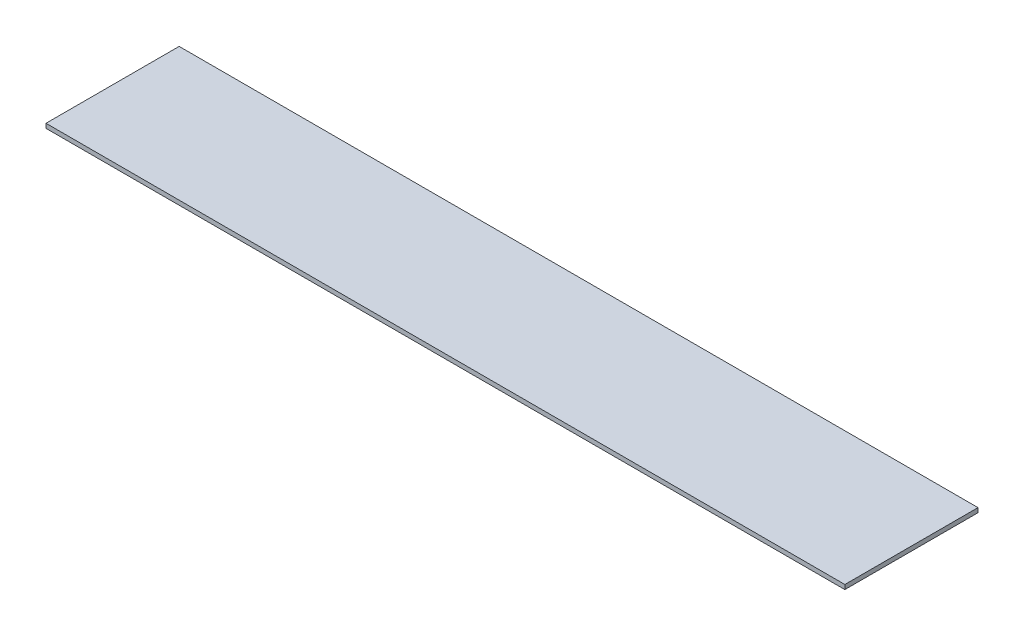
ISO-10303-21;
HEADER;
FILE_DESCRIPTION(('STEP AP214'),'2;1');
FILE_NAME('part.step','',(''),(''),'','','');
FILE_SCHEMA(('AUTOMOTIVE_DESIGN { 1 0 10303 214 1 1 1 1 }'));
ENDSEC;
DATA;
#1=APPLICATION_CONTEXT('core data for automotive mechanical design processes');
#2=APPLICATION_PROTOCOL_DEFINITION('international standard','automotive_design',2000,#1);
#3=PRODUCT_CONTEXT('',#1,'mechanical');
#4=PRODUCT('Part','Part','',(#3));
#5=PRODUCT_RELATED_PRODUCT_CATEGORY('part','',(#4));
#6=PRODUCT_DEFINITION_FORMATION('','',#4);
#7=PRODUCT_DEFINITION_CONTEXT('part definition',#1,'design');
#8=PRODUCT_DEFINITION('design','',#6,#7);
#9=PRODUCT_DEFINITION_SHAPE('','',#8);
#10=(LENGTH_UNIT() NAMED_UNIT(*) SI_UNIT(.MILLI.,.METRE.));
#11=(NAMED_UNIT(*) PLANE_ANGLE_UNIT() SI_UNIT($,.RADIAN.));
#12=(NAMED_UNIT(*) SI_UNIT($,.STERADIAN.) SOLID_ANGLE_UNIT());
#13=UNCERTAINTY_MEASURE_WITH_UNIT(LENGTH_MEASURE(1.E-05),#10,'distance_accuracy_value','');
#14=(GEOMETRIC_REPRESENTATION_CONTEXT(3) GLOBAL_UNCERTAINTY_ASSIGNED_CONTEXT((#13)) GLOBAL_UNIT_ASSIGNED_CONTEXT((#10,
#11,#12)) REPRESENTATION_CONTEXT('',''));
#15=CARTESIAN_POINT('',(0.,0.,0.));
#16=DIRECTION('',(0.,0.,1.));
#17=DIRECTION('',(1.,0.,0.));
#18=AXIS2_PLACEMENT_3D('',#15,#16,#17);
#19=CARTESIAN_POINT('',(450.,5.,75.));
#20=DIRECTION('',(-1.,0.,0.));
#21=DIRECTION('',(0.,0.,1.));
#22=AXIS2_PLACEMENT_3D('',#19,#20,#21);
#23=PLANE('',#22);
#24=DIRECTION('',(0.,0.,-1.));
#25=VECTOR('',#24,1.);
#26=CARTESIAN_POINT('',(450.,0.,75.));
#27=LINE('',#26,#25);
#28=CARTESIAN_POINT('',(450.,0.,75.));
#29=VERTEX_POINT('',#28);
#30=CARTESIAN_POINT('',(450.,0.,-75.));
#31=VERTEX_POINT('',#30);
#32=EDGE_CURVE('E96',#29,#31,#27,.T.);
#33=ORIENTED_EDGE('',*,*,#32,.T.);
#34=DIRECTION('',(0.,-1.,0.));
#35=VECTOR('',#34,1.);
#36=CARTESIAN_POINT('',(450.,5.,-75.));
#37=LINE('',#36,#35);
#38=CARTESIAN_POINT('',(450.,5.,-75.));
#39=VERTEX_POINT('',#38);
#40=EDGE_CURVE('E11',#39,#31,#37,.T.);
#41=ORIENTED_EDGE('',*,*,#40,.F.);
#42=DIRECTION('',(0.,0.,-1.));
#43=VECTOR('',#42,1.);
#44=CARTESIAN_POINT('',(450.,5.,75.));
#45=LINE('',#44,#43);
#46=CARTESIAN_POINT('',(450.,5.,75.));
#47=VERTEX_POINT('',#46);
#48=EDGE_CURVE('E84',#47,#39,#45,.T.);
#49=ORIENTED_EDGE('',*,*,#48,.F.);
#50=DIRECTION('',(0.,-1.,0.));
#51=VECTOR('',#50,1.);
#52=CARTESIAN_POINT('',(450.,5.,75.));
#53=LINE('',#52,#51);
#54=EDGE_CURVE('E92',#47,#29,#53,.T.);
#55=ORIENTED_EDGE('',*,*,#54,.T.);
#56=EDGE_LOOP('',(#33,#41,#49,#55));
#57=FACE_BOUND('',#56,.T.);
#58=ADVANCED_FACE('F33',(#57),#23,.F.);
#59=CARTESIAN_POINT('',(-450.,5.,-75.));
#60=DIRECTION('',(0.,0.,1.));
#61=DIRECTION('',(1.,0.,0.));
#62=AXIS2_PLACEMENT_3D('',#59,#60,#61);
#63=PLANE('',#62);
#64=DIRECTION('',(-1.,0.,0.));
#65=VECTOR('',#64,1.);
#66=CARTESIAN_POINT('',(-450.,0.,-75.));
#67=LINE('',#66,#65);
#68=CARTESIAN_POINT('',(-450.,0.,-75.));
#69=VERTEX_POINT('',#68);
#70=EDGE_CURVE('E88',#31,#69,#67,.T.);
#71=ORIENTED_EDGE('',*,*,#70,.T.);
#72=DIRECTION('',(0.,-1.,0.));
#73=VECTOR('',#72,1.);
#74=CARTESIAN_POINT('',(-450.,5.,-75.));
#75=LINE('',#74,#73);
#76=CARTESIAN_POINT('',(-450.,5.,-75.));
#77=VERTEX_POINT('',#76);
#78=EDGE_CURVE('E41',#77,#69,#75,.T.);
#79=ORIENTED_EDGE('',*,*,#78,.F.);
#80=DIRECTION('',(-1.,0.,0.));
#81=VECTOR('',#80,1.);
#82=CARTESIAN_POINT('',(-450.,5.,-75.));
#83=LINE('',#82,#81);
#84=EDGE_CURVE('E79',#39,#77,#83,.T.);
#85=ORIENTED_EDGE('',*,*,#84,.F.);
#86=ORIENTED_EDGE('',*,*,#40,.T.);
#87=EDGE_LOOP('',(#71,#79,#85,#86));
#88=FACE_BOUND('',#87,.T.);
#89=ADVANCED_FACE('F87',(#88),#63,.F.);
#90=CARTESIAN_POINT('',(-450.,5.,75.));
#91=DIRECTION('',(1.,0.,0.));
#92=DIRECTION('',(0.,0.,-1.));
#93=AXIS2_PLACEMENT_3D('',#90,#91,#92);
#94=PLANE('',#93);
#95=DIRECTION('',(0.,0.,1.));
#96=VECTOR('',#95,1.);
#97=CARTESIAN_POINT('',(-450.,0.,75.));
#98=LINE('',#97,#96);
#99=CARTESIAN_POINT('',(-450.,0.,75.));
#100=VERTEX_POINT('',#99);
#101=EDGE_CURVE('E66',#69,#100,#98,.T.);
#102=ORIENTED_EDGE('',*,*,#101,.T.);
#103=DIRECTION('',(0.,-1.,0.));
#104=VECTOR('',#103,1.);
#105=CARTESIAN_POINT('',(-450.,5.,75.));
#106=LINE('',#105,#104);
#107=CARTESIAN_POINT('',(-450.,5.,75.));
#108=VERTEX_POINT('',#107);
#109=EDGE_CURVE('E89',#108,#100,#106,.T.);
#110=ORIENTED_EDGE('',*,*,#109,.F.);
#111=DIRECTION('',(0.,0.,1.));
#112=VECTOR('',#111,1.);
#113=CARTESIAN_POINT('',(-450.,5.,75.));
#114=LINE('',#113,#112);
#115=EDGE_CURVE('E82',#77,#108,#114,.T.);
#116=ORIENTED_EDGE('',*,*,#115,.F.);
#117=ORIENTED_EDGE('',*,*,#78,.T.);
#118=EDGE_LOOP('',(#102,#110,#116,#117));
#119=FACE_BOUND('',#118,.T.);
#120=ADVANCED_FACE('F90',(#119),#94,.F.);
#121=CARTESIAN_POINT('',(-450.,5.,75.));
#122=DIRECTION('',(0.,0.,-1.));
#123=DIRECTION('',(-1.,0.,0.));
#124=AXIS2_PLACEMENT_3D('',#121,#122,#123);
#125=PLANE('',#124);
#126=DIRECTION('',(1.,0.,0.));
#127=VECTOR('',#126,1.);
#128=CARTESIAN_POINT('',(-450.,0.,75.));
#129=LINE('',#128,#127);
#130=EDGE_CURVE('E72',#100,#29,#129,.T.);
#131=ORIENTED_EDGE('',*,*,#130,.T.);
#132=ORIENTED_EDGE('',*,*,#54,.F.);
#133=DIRECTION('',(1.,0.,0.));
#134=VECTOR('',#133,1.);
#135=CARTESIAN_POINT('',(-450.,5.,75.));
#136=LINE('',#135,#134);
#137=EDGE_CURVE('E49',#108,#47,#136,.T.);
#138=ORIENTED_EDGE('',*,*,#137,.F.);
#139=ORIENTED_EDGE('',*,*,#109,.T.);
#140=EDGE_LOOP('',(#131,#132,#138,#139));
#141=FACE_BOUND('',#140,.T.);
#142=ADVANCED_FACE('F103',(#141),#125,.F.);
#143=CARTESIAN_POINT('',(0.,5.,0.));
#144=DIRECTION('',(0.,-1.,0.));
#145=DIRECTION('',(0.,0.,-1.));
#146=AXIS2_PLACEMENT_3D('',#143,#144,#145);
#147=PLANE('',#146);
#148=ORIENTED_EDGE('',*,*,#48,.T.);
#149=ORIENTED_EDGE('',*,*,#84,.T.);
#150=ORIENTED_EDGE('',*,*,#115,.T.);
#151=ORIENTED_EDGE('',*,*,#137,.T.);
#152=EDGE_LOOP('',(#148,#149,#150,#151));
#153=FACE_BOUND('',#152,.T.);
#154=ADVANCED_FACE('F80',(#153),#147,.F.);
#155=CARTESIAN_POINT('',(0.,0.,0.));
#156=DIRECTION('',(0.,-1.,0.));
#157=DIRECTION('',(0.,0.,-1.));
#158=AXIS2_PLACEMENT_3D('',#155,#156,#157);
#159=PLANE('',#158);
#160=ORIENTED_EDGE('',*,*,#32,.F.);
#161=ORIENTED_EDGE('',*,*,#130,.F.);
#162=ORIENTED_EDGE('',*,*,#101,.F.);
#163=ORIENTED_EDGE('',*,*,#70,.F.);
#164=EDGE_LOOP('',(#160,#161,#162,#163));
#165=FACE_BOUND('',#164,.T.);
#166=ADVANCED_FACE('F106',(#165),#159,.T.);
#167=CLOSED_SHELL('',(#58,#89,#120,#142,#154,#166));
#168=MANIFOLD_SOLID_BREP('B2',#167);
#169=ADVANCED_BREP_SHAPE_REPRESENTATION('',(#18,#168),#14);
#170=SHAPE_DEFINITION_REPRESENTATION(#9,#169);
ENDSEC;
END-ISO-10303-21;
